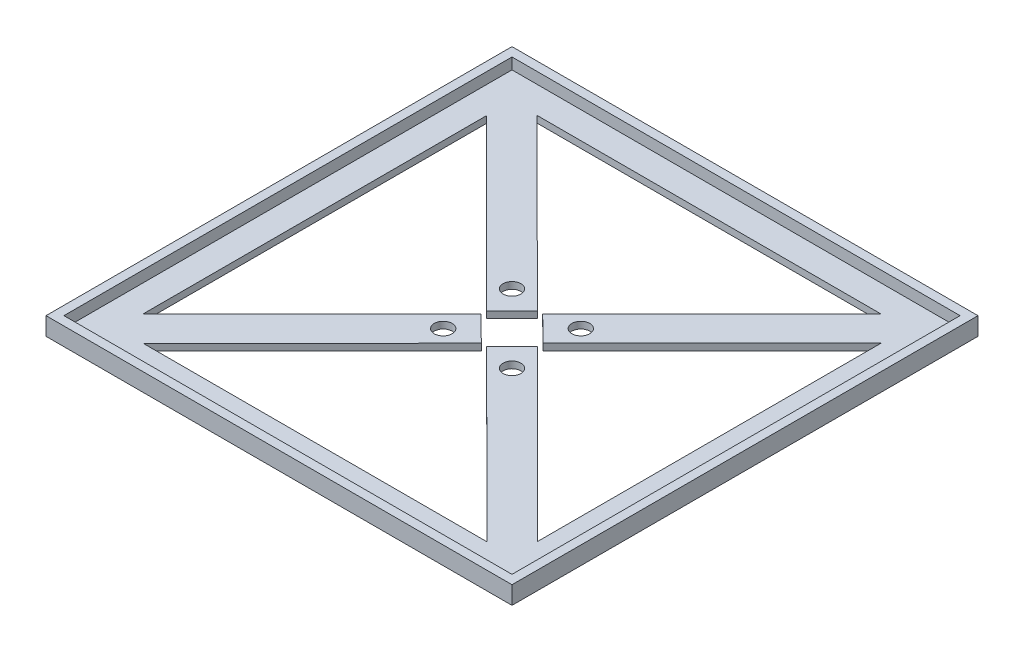
ISO-10303-21;
HEADER;
FILE_DESCRIPTION(('STEP AP214'),'2;1');
FILE_NAME('part.step','',(''),(''),'','','');
FILE_SCHEMA(('AUTOMOTIVE_DESIGN { 1 0 10303 214 1 1 1 1 }'));
ENDSEC;
DATA;
#1=APPLICATION_CONTEXT('core data for automotive mechanical design processes');
#2=APPLICATION_PROTOCOL_DEFINITION('international standard','automotive_design',2000,#1);
#3=PRODUCT_CONTEXT('',#1,'mechanical');
#4=PRODUCT('Part','Part','',(#3));
#5=PRODUCT_RELATED_PRODUCT_CATEGORY('part','',(#4));
#6=PRODUCT_DEFINITION_FORMATION('','',#4);
#7=PRODUCT_DEFINITION_CONTEXT('part definition',#1,'design');
#8=PRODUCT_DEFINITION('design','',#6,#7);
#9=PRODUCT_DEFINITION_SHAPE('','',#8);
#10=(LENGTH_UNIT() NAMED_UNIT(*) SI_UNIT(.MILLI.,.METRE.));
#11=(NAMED_UNIT(*) PLANE_ANGLE_UNIT() SI_UNIT($,.RADIAN.));
#12=(NAMED_UNIT(*) SI_UNIT($,.STERADIAN.) SOLID_ANGLE_UNIT());
#13=UNCERTAINTY_MEASURE_WITH_UNIT(LENGTH_MEASURE(1.E-05),#10,'distance_accuracy_value','');
#14=(GEOMETRIC_REPRESENTATION_CONTEXT(3) GLOBAL_UNCERTAINTY_ASSIGNED_CONTEXT((#13)) GLOBAL_UNIT_ASSIGNED_CONTEXT((#10,
#11,#12)) REPRESENTATION_CONTEXT('',''));
#15=CARTESIAN_POINT('',(0.,0.,0.));
#16=DIRECTION('',(0.,0.,1.));
#17=DIRECTION('',(1.,0.,0.));
#18=AXIS2_PLACEMENT_3D('',#15,#16,#17);
#19=CARTESIAN_POINT('',(0.,0.75,-24.1638593004796));
#20=DIRECTION('',(0.,0.,-1.));
#21=DIRECTION('',(-1.,0.,0.));
#22=AXIS2_PLACEMENT_3D('',#19,#20,#21);
#23=PLANE('',#22);
#24=DIRECTION('',(0.,1.,0.));
#25=VECTOR('',#24,1.);
#26=CARTESIAN_POINT('',(-25.5005446198042,0.75,-24.1638593004796));
#27=LINE('',#26,#25);
#28=CARTESIAN_POINT('',(-25.5005446198042,0.,-24.1638593004796));
#29=VERTEX_POINT('',#28);
#30=CARTESIAN_POINT('',(-25.5005446198042,0.75,-24.1638593004796));
#31=VERTEX_POINT('',#30);
#32=EDGE_CURVE('E340',#29,#31,#27,.T.);
#33=ORIENTED_EDGE('',*,*,#32,.F.);
#34=DIRECTION('',(1.,0.,0.));
#35=VECTOR('',#34,1.);
#36=CARTESIAN_POINT('',(0.,0.,-24.1638593004796));
#37=LINE('',#36,#35);
#38=CARTESIAN_POINT('',(12.8426470451121,0.,-24.1638593004796));
#39=VERTEX_POINT('',#38);
#40=EDGE_CURVE('E424',#29,#39,#37,.T.);
#41=ORIENTED_EDGE('',*,*,#40,.T.);
#42=DIRECTION('',(0.,-1.,0.));
#43=VECTOR('',#42,1.);
#44=CARTESIAN_POINT('',(12.8426470451121,0.75,-24.1638593004796));
#45=LINE('',#44,#43);
#46=CARTESIAN_POINT('',(12.8426470451121,0.75,-24.1638593004796));
#47=VERTEX_POINT('',#46);
#48=EDGE_CURVE('E12',#47,#39,#45,.T.);
#49=ORIENTED_EDGE('',*,*,#48,.F.);
#50=DIRECTION('',(1.,0.,0.));
#51=VECTOR('',#50,1.);
#52=CARTESIAN_POINT('',(0.,0.75,-24.1638593004796));
#53=LINE('',#52,#51);
#54=EDGE_CURVE('E425',#31,#47,#53,.T.);
#55=ORIENTED_EDGE('',*,*,#54,.F.);
#56=EDGE_LOOP('',(#33,#41,#49,#55));
#57=FACE_BOUND('',#56,.T.);
#58=ADVANCED_FACE('F85',(#57),#23,.F.);
#59=CARTESIAN_POINT('',(-28.2989469789886,0.75,0.));
#60=DIRECTION('',(1.,0.,0.));
#61=DIRECTION('',(0.,0.,-1.));
#62=AXIS2_PLACEMENT_3D('',#59,#60,#61);
#63=PLANE('',#62);
#64=DIRECTION('',(0.,0.,1.));
#65=VECTOR('',#64,1.);
#66=CARTESIAN_POINT('',(-28.2989469789886,0.,0.));
#67=LINE('',#66,#65);
#68=CARTESIAN_POINT('',(-28.2989469789886,0.,-21.3054533245803));
#69=VERTEX_POINT('',#68);
#70=CARTESIAN_POINT('',(-28.2989469789886,0.,17.0377383403361));
#71=VERTEX_POINT('',#70);
#72=EDGE_CURVE('E427',#69,#71,#67,.T.);
#73=ORIENTED_EDGE('',*,*,#72,.F.);
#74=DIRECTION('',(0.,1.,0.));
#75=VECTOR('',#74,1.);
#76=CARTESIAN_POINT('',(-28.2989469789886,0.75,-21.3054533245803));
#77=LINE('',#76,#75);
#78=CARTESIAN_POINT('',(-28.2989469789886,0.75,-21.3054533245803));
#79=VERTEX_POINT('',#78);
#80=EDGE_CURVE('E337',#69,#79,#77,.T.);
#81=ORIENTED_EDGE('',*,*,#80,.T.);
#82=DIRECTION('',(0.,0.,1.));
#83=VECTOR('',#82,1.);
#84=CARTESIAN_POINT('',(-28.2989469789886,0.75,0.));
#85=LINE('',#84,#83);
#86=CARTESIAN_POINT('',(-28.2989469789886,0.75,17.0377383403361));
#87=VERTEX_POINT('',#86);
#88=EDGE_CURVE('E431',#79,#87,#85,.T.);
#89=ORIENTED_EDGE('',*,*,#88,.T.);
#90=DIRECTION('',(0.,-1.,0.));
#91=VECTOR('',#90,1.);
#92=CARTESIAN_POINT('',(-28.2989469789886,0.75,17.037738340336));
#93=LINE('',#92,#91);
#94=EDGE_CURVE('E450',#87,#71,#93,.T.);
#95=ORIENTED_EDGE('',*,*,#94,.T.);
#96=EDGE_LOOP('',(#73,#81,#89,#95));
#97=FACE_BOUND('',#96,.T.);
#98=ADVANCED_FACE('F481',(#97),#63,.T.);
#99=CARTESIAN_POINT('',(15.7010530210114,0.75,0.));
#100=DIRECTION('',(1.,0.,0.));
#101=DIRECTION('',(0.,0.,-1.));
#102=AXIS2_PLACEMENT_3D('',#99,#100,#101);
#103=PLANE('',#102);
#104=DIRECTION('',(0.,1.,0.));
#105=VECTOR('',#104,1.);
#106=CARTESIAN_POINT('',(15.7010530210114,0.75,-21.3654569412953));
#107=LINE('',#106,#105);
#108=CARTESIAN_POINT('',(15.7010530210114,0.,-21.3654569412953));
#109=VERTEX_POINT('',#108);
#110=CARTESIAN_POINT('',(15.7010530210114,0.75,-21.3654569412953));
#111=VERTEX_POINT('',#110);
#112=EDGE_CURVE('E368',#109,#111,#107,.T.);
#113=ORIENTED_EDGE('',*,*,#112,.F.);
#114=DIRECTION('',(0.,0.,1.));
#115=VECTOR('',#114,1.);
#116=CARTESIAN_POINT('',(15.7010530210114,0.,0.));
#117=LINE('',#116,#115);
#118=CARTESIAN_POINT('',(15.7010530210114,0.,16.977734723621));
#119=VERTEX_POINT('',#118);
#120=EDGE_CURVE('E434',#109,#119,#117,.T.);
#121=ORIENTED_EDGE('',*,*,#120,.T.);
#122=DIRECTION('',(0.,-1.,0.));
#123=VECTOR('',#122,1.);
#124=CARTESIAN_POINT('',(15.7010530210114,0.75,16.977734723621));
#125=LINE('',#124,#123);
#126=CARTESIAN_POINT('',(15.7010530210114,0.75,16.977734723621));
#127=VERTEX_POINT('',#126);
#128=EDGE_CURVE('E93',#127,#119,#125,.T.);
#129=ORIENTED_EDGE('',*,*,#128,.F.);
#130=DIRECTION('',(0.,0.,1.));
#131=VECTOR('',#130,1.);
#132=CARTESIAN_POINT('',(15.7010530210114,0.75,0.));
#133=LINE('',#132,#131);
#134=EDGE_CURVE('E108',#111,#127,#133,.T.);
#135=ORIENTED_EDGE('',*,*,#134,.F.);
#136=EDGE_LOOP('',(#113,#121,#129,#135));
#137=FACE_BOUND('',#136,.T.);
#138=ADVANCED_FACE('F478',(#137),#103,.F.);
#139=CARTESIAN_POINT('',(0.,0.75,19.8361406995204));
#140=DIRECTION('',(0.,0.,-1.));
#141=DIRECTION('',(-1.,0.,0.));
#142=AXIS2_PLACEMENT_3D('',#139,#140,#141);
#143=PLANE('',#142);
#144=DIRECTION('',(1.,0.,0.));
#145=VECTOR('',#144,1.);
#146=CARTESIAN_POINT('',(0.,0.75,19.8361406995204));
#147=LINE('',#146,#145);
#148=CARTESIAN_POINT('',(-25.4405410030892,0.75,19.8361406995204));
#149=VERTEX_POINT('',#148);
#150=CARTESIAN_POINT('',(12.9026506618271,0.75,19.8361406995204));
#151=VERTEX_POINT('',#150);
#152=EDGE_CURVE('E429',#149,#151,#147,.T.);
#153=ORIENTED_EDGE('',*,*,#152,.T.);
#154=DIRECTION('',(0.,-1.,0.));
#155=VECTOR('',#154,1.);
#156=CARTESIAN_POINT('',(12.9026506618271,0.75,19.8361406995204));
#157=LINE('',#156,#155);
#158=CARTESIAN_POINT('',(12.9026506618271,0.,19.8361406995204));
#159=VERTEX_POINT('',#158);
#160=EDGE_CURVE('E396',#151,#159,#157,.T.);
#161=ORIENTED_EDGE('',*,*,#160,.T.);
#162=DIRECTION('',(1.,0.,0.));
#163=VECTOR('',#162,1.);
#164=CARTESIAN_POINT('',(0.,0.,19.8361406995204));
#165=LINE('',#164,#163);
#166=CARTESIAN_POINT('',(-25.4405410030892,0.,19.8361406995204));
#167=VERTEX_POINT('',#166);
#168=EDGE_CURVE('E436',#167,#159,#165,.T.);
#169=ORIENTED_EDGE('',*,*,#168,.F.);
#170=DIRECTION('',(0.,1.,0.));
#171=VECTOR('',#170,1.);
#172=CARTESIAN_POINT('',(-25.4405410030892,0.75,19.8361406995204));
#173=LINE('',#172,#171);
#174=EDGE_CURVE('E447',#167,#149,#173,.T.);
#175=ORIENTED_EDGE('',*,*,#174,.T.);
#176=EDGE_LOOP('',(#153,#161,#169,#175));
#177=FACE_BOUND('',#176,.T.);
#178=ADVANCED_FACE('F480',(#177),#143,.T.);
#179=CARTESIAN_POINT('',(0.,0.75,0.));
#180=DIRECTION('',(0.,-1.,0.));
#181=DIRECTION('',(0.,0.,-1.));
#182=AXIS2_PLACEMENT_3D('',#179,#180,#181);
#183=PLANE('',#182);
#184=DIRECTION('',(-0.707668696877532,0.,-0.706544418603428));
#185=VECTOR('',#184,1.);
#186=CARTESIAN_POINT('',(-0.64808539249805,0.75,0.649116648718275));
#187=LINE('',#186,#185);
#188=CARTESIAN_POINT('',(-6.60223918650174,0.75,-5.29557773895472));
#189=VERTEX_POINT('',#188);
#190=EDGE_CURVE('E318',#189,#31,#187,.T.);
#191=ORIENTED_EDGE('',*,*,#190,.T.);
#192=ORIENTED_EDGE('',*,*,#54,.T.);
#193=DIRECTION('',(-0.706544418603427,0.,0.707668696877533));
#194=VECTOR('',#193,1.);
#195=CARTESIAN_POINT('',(-5.65038115024693,0.75,-5.64140434966826));
#196=LINE('',#195,#194);
#197=CARTESIAN_POINT('',(-5.99790332802358,0.75,-5.2933291824065));
#198=VERTEX_POINT('',#197);
#199=EDGE_CURVE('E346',#47,#198,#196,.T.);
#200=ORIENTED_EDGE('',*,*,#199,.T.);
#201=DIRECTION('',(0.707668696877532,0.,0.706544418603427));
#202=VECTOR('',#201,1.);
#203=CARTESIAN_POINT('',(-0.347522177776656,0.75,0.348075167261757));
#204=LINE('',#203,#202);
#205=CARTESIAN_POINT('',(-3.16722854051345,0.75,-2.46715150799279));
#206=VERTEX_POINT('',#205);
#207=EDGE_CURVE('E349',#198,#206,#204,.T.);
#208=ORIENTED_EDGE('',*,*,#207,.T.);
#209=DIRECTION('',(0.706544418603427,0.,-0.707668696877532));
#210=VECTOR('',#209,1.);
#211=CARTESIAN_POINT('',(-2.8197063627368,0.75,-2.81522667525455));
#212=LINE('',#211,#210);
#213=EDGE_CURVE('E351',#206,#111,#212,.T.);
#214=ORIENTED_EDGE('',*,*,#213,.T.);
#215=ORIENTED_EDGE('',*,*,#134,.T.);
#216=DIRECTION('',(-0.707668696877533,0.,-0.706544418603427));
#217=VECTOR('',#216,1.);
#218=CARTESIAN_POINT('',(-0.650812215781393,0.75,0.651847811018522));
#219=LINE('',#218,#217);
#220=CARTESIAN_POINT('',(-3.16947709706168,0.75,-1.86281564951464));
#221=VERTEX_POINT('',#220);
#222=EDGE_CURVE('E374',#127,#221,#219,.T.);
#223=ORIENTED_EDGE('',*,*,#222,.T.);
#224=DIRECTION('',(-0.706544418603427,0.,0.707668696877532));
#225=VECTOR('',#224,1.);
#226=CARTESIAN_POINT('',(-2.51866488128028,0.75,-2.51466346053316));
#227=LINE('',#226,#225);
#228=CARTESIAN_POINT('',(-5.99565477147538,0.75,0.967859137995492));
#229=VERTEX_POINT('',#228);
#230=EDGE_CURVE('E377',#221,#229,#227,.T.);
#231=ORIENTED_EDGE('',*,*,#230,.T.);
#232=DIRECTION('',(0.707668696877532,0.,0.706544418603427));
#233=VECTOR('',#232,1.);
#234=CARTESIAN_POINT('',(-3.4769898901951,0.75,3.48252259852865));
#235=LINE('',#234,#233);
#236=EDGE_CURVE('E379',#229,#151,#235,.T.);
#237=ORIENTED_EDGE('',*,*,#236,.T.);
#238=ORIENTED_EDGE('',*,*,#152,.F.);
#239=DIRECTION('',(0.706544418603427,0.,-0.707668696877533));
#240=VECTOR('',#239,1.);
#241=CARTESIAN_POINT('',(-2.82243752503705,0.75,-2.8179534985379));
#242=LINE('',#241,#240);
#243=CARTESIAN_POINT('',(-6.59999062995354,0.75,0.965610581447271));
#244=VERTEX_POINT('',#243);
#245=EDGE_CURVE('E402',#149,#244,#242,.T.);
#246=ORIENTED_EDGE('',*,*,#245,.T.);
#247=DIRECTION('',(-0.707668696877532,0.,-0.706544418603428));
#248=VECTOR('',#247,1.);
#249=CARTESIAN_POINT('',(-3.77755310491649,0.75,3.78356407998517));
#250=LINE('',#249,#248);
#251=CARTESIAN_POINT('',(-9.43066541746366,0.75,-1.86056709296644));
#252=VERTEX_POINT('',#251);
#253=EDGE_CURVE('E405',#244,#252,#250,.T.);
#254=ORIENTED_EDGE('',*,*,#253,.T.);
#255=DIRECTION('',(-0.706544418603427,0.,0.707668696877532));
#256=VECTOR('',#255,1.);
#257=CARTESIAN_POINT('',(-5.65311231254717,0.75,-5.6441311729516));
#258=LINE('',#257,#256);
#259=EDGE_CURVE('E407',#252,#87,#258,.T.);
#260=ORIENTED_EDGE('',*,*,#259,.T.);
#261=ORIENTED_EDGE('',*,*,#88,.F.);
#262=DIRECTION('',(0.707668696877533,0.,0.706544418603427));
#263=VECTOR('',#262,1.);
#264=CARTESIAN_POINT('',(-3.47426306691175,0.75,3.4797914362284));
#265=LINE('',#264,#263);
#266=CARTESIAN_POINT('',(-9.42841686091544,0.75,-2.46490295144459));
#267=VERTEX_POINT('',#266);
#268=EDGE_CURVE('E321',#79,#267,#265,.T.);
#269=ORIENTED_EDGE('',*,*,#268,.T.);
#270=DIRECTION('',(0.706544418603427,0.,-0.707668696877532));
#271=VECTOR('',#270,1.);
#272=CARTESIAN_POINT('',(-5.95415379400369,0.75,-5.94469438767299));
#273=LINE('',#272,#271);
#274=EDGE_CURVE('E315',#267,#189,#273,.T.);
#275=ORIENTED_EDGE('',*,*,#274,.T.);
#276=EDGE_LOOP('',(#191,#192,#200,#208,#214,#215,#223,#231,#237,#238,#246,#254,#260,#261,#269,#275));
#277=FACE_BOUND('',#276,.T.);
#278=DIRECTION('',(0.,0.,1.));
#279=VECTOR('',#278,1.);
#280=CARTESIAN_POINT('',(18.7010530210114,0.75,-27.1638593004796));
#281=LINE('',#280,#279);
#282=CARTESIAN_POINT('',(18.7010530210114,0.75,-27.1638593004796));
#283=VERTEX_POINT('',#282);
#284=CARTESIAN_POINT('',(18.7010530210114,0.75,22.8361406995204));
#285=VERTEX_POINT('',#284);
#286=EDGE_CURVE('E441',#283,#285,#281,.T.);
#287=ORIENTED_EDGE('',*,*,#286,.F.);
#288=DIRECTION('',(1.,0.,0.));
#289=VECTOR('',#288,1.);
#290=CARTESIAN_POINT('',(-31.2989469789886,0.75,-27.1638593004796));
#291=LINE('',#290,#289);
#292=CARTESIAN_POINT('',(-31.2989469789886,0.75,-27.1638593004796));
#293=VERTEX_POINT('',#292);
#294=EDGE_CURVE('E254',#293,#283,#291,.T.);
#295=ORIENTED_EDGE('',*,*,#294,.F.);
#296=DIRECTION('',(0.,0.,1.));
#297=VECTOR('',#296,1.);
#298=CARTESIAN_POINT('',(-31.2989469789886,0.75,-27.1638593004796));
#299=LINE('',#298,#297);
#300=CARTESIAN_POINT('',(-31.2989469789886,0.75,22.8361406995204));
#301=VERTEX_POINT('',#300);
#302=EDGE_CURVE('E445',#293,#301,#299,.T.);
#303=ORIENTED_EDGE('',*,*,#302,.T.);
#304=DIRECTION('',(1.,0.,0.));
#305=VECTOR('',#304,1.);
#306=CARTESIAN_POINT('',(-31.2989469789886,0.75,22.8361406995204));
#307=LINE('',#306,#305);
#308=EDGE_CURVE('E443',#301,#285,#307,.T.);
#309=ORIENTED_EDGE('',*,*,#308,.T.);
#310=EDGE_LOOP('',(#287,#295,#303,#309));
#311=FACE_BOUND('',#310,.T.);
#312=CARTESIAN_POINT('',(-2.46124559070888,0.75,1.67384208780007));
#313=DIRECTION('',(0.,1.,0.));
#314=DIRECTION('',(0.,0.,1.));
#315=AXIS2_PLACEMENT_3D('',#312,#313,#314);
#316=CIRCLE('',#315,1.);
#317=CARTESIAN_POINT('',(-2.46124559070888,0.75,2.67384208780007));
#318=VERTEX_POINT('',#317);
#319=EDGE_CURVE('E371',#318,#318,#316,.T.);
#320=ORIENTED_EDGE('',*,*,#319,.F.);
#321=EDGE_LOOP('',(#320));
#322=FACE_BOUND('',#321,.T.);
#323=CARTESIAN_POINT('',(-10.1366483672682,0.75,1.67384208780007));
#324=DIRECTION('',(0.,1.,0.));
#325=DIRECTION('',(0.,0.,1.));
#326=AXIS2_PLACEMENT_3D('',#323,#324,#325);
#327=CIRCLE('',#326,1.);
#328=CARTESIAN_POINT('',(-10.1366483672682,0.75,2.67384208780007));
#329=VERTEX_POINT('',#328);
#330=EDGE_CURVE('E399',#329,#329,#327,.T.);
#331=ORIENTED_EDGE('',*,*,#330,.F.);
#332=EDGE_LOOP('',(#331));
#333=FACE_BOUND('',#332,.T.);
#334=CARTESIAN_POINT('',(-2.46124559070888,0.75,-6.00156068875929));
#335=DIRECTION('',(0.,1.,0.));
#336=DIRECTION('',(0.,0.,1.));
#337=AXIS2_PLACEMENT_3D('',#334,#335,#336);
#338=CIRCLE('',#337,1.);
#339=CARTESIAN_POINT('',(-2.46124559070888,0.75,-5.00156068875929));
#340=VERTEX_POINT('',#339);
#341=EDGE_CURVE('E343',#340,#340,#338,.T.);
#342=ORIENTED_EDGE('',*,*,#341,.F.);
#343=EDGE_LOOP('',(#342));
#344=FACE_BOUND('',#343,.T.);
#345=CARTESIAN_POINT('',(-10.1366483672682,0.75,-6.00156068875929));
#346=DIRECTION('',(0.,1.,0.));
#347=DIRECTION('',(0.,0.,1.));
#348=AXIS2_PLACEMENT_3D('',#345,#346,#347);
#349=CIRCLE('',#348,1.);
#350=CARTESIAN_POINT('',(-10.1366483672682,0.75,-5.00156068875929));
#351=VERTEX_POINT('',#350);
#352=EDGE_CURVE('E312',#351,#351,#349,.T.);
#353=ORIENTED_EDGE('',*,*,#352,.F.);
#354=EDGE_LOOP('',(#353));
#355=FACE_BOUND('',#354,.T.);
#356=ADVANCED_FACE('F470',(#277,#311,#322,#333,#344,#355),#183,.F.);
#357=CARTESIAN_POINT('',(0.,0.,0.));
#358=DIRECTION('',(0.,-1.,0.));
#359=DIRECTION('',(0.,0.,-1.));
#360=AXIS2_PLACEMENT_3D('',#357,#358,#359);
#361=PLANE('',#360);
#362=ORIENTED_EDGE('',*,*,#40,.F.);
#363=DIRECTION('',(-0.707668696877532,0.,-0.706544418603428));
#364=VECTOR('',#363,1.);
#365=CARTESIAN_POINT('',(-0.64808539249805,0.,0.649116648718275));
#366=LINE('',#365,#364);
#367=CARTESIAN_POINT('',(-6.60223918650174,0.,-5.29557773895472));
#368=VERTEX_POINT('',#367);
#369=EDGE_CURVE('E329',#368,#29,#366,.T.);
#370=ORIENTED_EDGE('',*,*,#369,.F.);
#371=DIRECTION('',(0.706544418603427,0.,-0.707668696877532));
#372=VECTOR('',#371,1.);
#373=CARTESIAN_POINT('',(-5.95415379400369,0.,-5.94469438767299));
#374=LINE('',#373,#372);
#375=CARTESIAN_POINT('',(-9.42841686091544,0.,-2.46490295144459));
#376=VERTEX_POINT('',#375);
#377=EDGE_CURVE('E326',#376,#368,#374,.T.);
#378=ORIENTED_EDGE('',*,*,#377,.F.);
#379=DIRECTION('',(0.707668696877533,0.,0.706544418603427));
#380=VECTOR('',#379,1.);
#381=CARTESIAN_POINT('',(-3.47426306691175,0.,3.4797914362284));
#382=LINE('',#381,#380);
#383=EDGE_CURVE('E100',#69,#376,#382,.T.);
#384=ORIENTED_EDGE('',*,*,#383,.F.);
#385=ORIENTED_EDGE('',*,*,#72,.T.);
#386=DIRECTION('',(-0.706544418603427,0.,0.707668696877532));
#387=VECTOR('',#386,1.);
#388=CARTESIAN_POINT('',(-5.65311231254717,0.,-5.6441311729516));
#389=LINE('',#388,#387);
#390=CARTESIAN_POINT('',(-9.43066541746366,0.,-1.86056709296644));
#391=VERTEX_POINT('',#390);
#392=EDGE_CURVE('E403',#391,#71,#389,.T.);
#393=ORIENTED_EDGE('',*,*,#392,.F.);
#394=DIRECTION('',(-0.707668696877532,0.,-0.706544418603428));
#395=VECTOR('',#394,1.);
#396=CARTESIAN_POINT('',(-3.77755310491649,0.,3.78356407998517));
#397=LINE('',#396,#395);
#398=CARTESIAN_POINT('',(-6.59999062995354,0.,0.965610581447271));
#399=VERTEX_POINT('',#398);
#400=EDGE_CURVE('E415',#399,#391,#397,.T.);
#401=ORIENTED_EDGE('',*,*,#400,.F.);
#402=DIRECTION('',(0.706544418603427,0.,-0.707668696877533));
#403=VECTOR('',#402,1.);
#404=CARTESIAN_POINT('',(-2.82243752503705,0.,-2.8179534985379));
#405=LINE('',#404,#403);
#406=EDGE_CURVE('E413',#167,#399,#405,.T.);
#407=ORIENTED_EDGE('',*,*,#406,.F.);
#408=ORIENTED_EDGE('',*,*,#168,.T.);
#409=DIRECTION('',(0.707668696877532,0.,0.706544418603427));
#410=VECTOR('',#409,1.);
#411=CARTESIAN_POINT('',(-3.4769898901951,0.,3.48252259852865));
#412=LINE('',#411,#410);
#413=CARTESIAN_POINT('',(-5.99565477147538,0.,0.967859137995492));
#414=VERTEX_POINT('',#413);
#415=EDGE_CURVE('E375',#414,#159,#412,.T.);
#416=ORIENTED_EDGE('',*,*,#415,.F.);
#417=DIRECTION('',(-0.706544418603427,0.,0.707668696877532));
#418=VECTOR('',#417,1.);
#419=CARTESIAN_POINT('',(-2.51866488128028,0.,-2.51466346053316));
#420=LINE('',#419,#418);
#421=CARTESIAN_POINT('',(-3.16947709706168,0.,-1.86281564951464));
#422=VERTEX_POINT('',#421);
#423=EDGE_CURVE('E387',#422,#414,#420,.T.);
#424=ORIENTED_EDGE('',*,*,#423,.F.);
#425=DIRECTION('',(-0.707668696877533,0.,-0.706544418603427));
#426=VECTOR('',#425,1.);
#427=CARTESIAN_POINT('',(-0.650812215781393,0.,0.651847811018522));
#428=LINE('',#427,#426);
#429=EDGE_CURVE('E385',#119,#422,#428,.T.);
#430=ORIENTED_EDGE('',*,*,#429,.F.);
#431=ORIENTED_EDGE('',*,*,#120,.F.);
#432=DIRECTION('',(0.706544418603427,0.,-0.707668696877532));
#433=VECTOR('',#432,1.);
#434=CARTESIAN_POINT('',(-2.8197063627368,0.,-2.81522667525455));
#435=LINE('',#434,#433);
#436=CARTESIAN_POINT('',(-3.16722854051345,0.,-2.46715150799279));
#437=VERTEX_POINT('',#436);
#438=EDGE_CURVE('E347',#437,#109,#435,.T.);
#439=ORIENTED_EDGE('',*,*,#438,.F.);
#440=DIRECTION('',(0.707668696877532,0.,0.706544418603427));
#441=VECTOR('',#440,1.);
#442=CARTESIAN_POINT('',(-0.347522177776656,0.,0.348075167261757));
#443=LINE('',#442,#441);
#444=CARTESIAN_POINT('',(-5.99790332802358,0.,-5.2933291824065));
#445=VERTEX_POINT('',#444);
#446=EDGE_CURVE('E359',#445,#437,#443,.T.);
#447=ORIENTED_EDGE('',*,*,#446,.F.);
#448=DIRECTION('',(-0.706544418603427,0.,0.707668696877533));
#449=VECTOR('',#448,1.);
#450=CARTESIAN_POINT('',(-5.65038115024693,0.,-5.64140434966826));
#451=LINE('',#450,#449);
#452=EDGE_CURVE('E357',#39,#445,#451,.T.);
#453=ORIENTED_EDGE('',*,*,#452,.F.);
#454=EDGE_LOOP('',(#362,#370,#378,#384,#385,#393,#401,#407,#408,#416,#424,#430,#431,#439,#447,#453));
#455=FACE_BOUND('',#454,.T.);
#456=CARTESIAN_POINT('',(-2.46124559070888,0.,-6.00156068875929));
#457=DIRECTION('',(0.,1.,0.));
#458=DIRECTION('',(0.,0.,1.));
#459=AXIS2_PLACEMENT_3D('',#456,#457,#458);
#460=CIRCLE('',#459,1.);
#461=CARTESIAN_POINT('',(-2.46124559070888,0.,-5.00156068875929));
#462=VERTEX_POINT('',#461);
#463=EDGE_CURVE('E342',#462,#462,#460,.T.);
#464=ORIENTED_EDGE('',*,*,#463,.T.);
#465=EDGE_LOOP('',(#464));
#466=FACE_BOUND('',#465,.T.);
#467=CARTESIAN_POINT('',(-2.46124559070888,0.,1.67384208780007));
#468=DIRECTION('',(0.,1.,0.));
#469=DIRECTION('',(0.,0.,1.));
#470=AXIS2_PLACEMENT_3D('',#467,#468,#469);
#471=CIRCLE('',#470,1.);
#472=CARTESIAN_POINT('',(-2.46124559070888,0.,2.67384208780007));
#473=VERTEX_POINT('',#472);
#474=EDGE_CURVE('E370',#473,#473,#471,.T.);
#475=ORIENTED_EDGE('',*,*,#474,.T.);
#476=EDGE_LOOP('',(#475));
#477=FACE_BOUND('',#476,.T.);
#478=CARTESIAN_POINT('',(-10.1366483672682,0.,1.67384208780007));
#479=DIRECTION('',(0.,1.,0.));
#480=DIRECTION('',(0.,0.,1.));
#481=AXIS2_PLACEMENT_3D('',#478,#479,#480);
#482=CIRCLE('',#481,1.);
#483=CARTESIAN_POINT('',(-10.1366483672682,0.,2.67384208780007));
#484=VERTEX_POINT('',#483);
#485=EDGE_CURVE('E398',#484,#484,#482,.T.);
#486=ORIENTED_EDGE('',*,*,#485,.T.);
#487=EDGE_LOOP('',(#486));
#488=FACE_BOUND('',#487,.T.);
#489=CARTESIAN_POINT('',(-10.1366483672682,0.,-6.00156068875929));
#490=DIRECTION('',(0.,1.,0.));
#491=DIRECTION('',(0.,0.,1.));
#492=AXIS2_PLACEMENT_3D('',#489,#490,#491);
#493=CIRCLE('',#492,1.);
#494=CARTESIAN_POINT('',(-10.1366483672682,0.,-5.00156068875929));
#495=VERTEX_POINT('',#494);
#496=EDGE_CURVE('E305',#495,#495,#493,.T.);
#497=ORIENTED_EDGE('',*,*,#496,.T.);
#498=EDGE_LOOP('',(#497));
#499=FACE_BOUND('',#498,.T.);
#500=DIRECTION('',(1.,0.,0.));
#501=VECTOR('',#500,1.);
#502=CARTESIAN_POINT('',(0.,0.,-28.1638593004796));
#503=LINE('',#502,#501);
#504=CARTESIAN_POINT('',(-32.2989469789886,0.,-28.1638593004796));
#505=VERTEX_POINT('',#504);
#506=CARTESIAN_POINT('',(19.7010530210114,0.,-28.1638593004796));
#507=VERTEX_POINT('',#506);
#508=EDGE_CURVE('E277',#505,#507,#503,.T.);
#509=ORIENTED_EDGE('',*,*,#508,.T.);
#510=DIRECTION('',(0.,0.,1.));
#511=VECTOR('',#510,1.);
#512=CARTESIAN_POINT('',(19.7010530210114,0.,0.));
#513=LINE('',#512,#511);
#514=CARTESIAN_POINT('',(19.7010530210114,0.,23.8361406995204));
#515=VERTEX_POINT('',#514);
#516=EDGE_CURVE('E296',#507,#515,#513,.T.);
#517=ORIENTED_EDGE('',*,*,#516,.T.);
#518=DIRECTION('',(1.,0.,0.));
#519=VECTOR('',#518,1.);
#520=CARTESIAN_POINT('',(0.,0.,23.8361406995204));
#521=LINE('',#520,#519);
#522=CARTESIAN_POINT('',(-32.2989469789886,0.,23.8361406995204));
#523=VERTEX_POINT('',#522);
#524=EDGE_CURVE('E299',#523,#515,#521,.T.);
#525=ORIENTED_EDGE('',*,*,#524,.F.);
#526=DIRECTION('',(0.,0.,1.));
#527=VECTOR('',#526,1.);
#528=CARTESIAN_POINT('',(-32.2989469789886,0.,0.));
#529=LINE('',#528,#527);
#530=EDGE_CURVE('E286',#505,#523,#529,.T.);
#531=ORIENTED_EDGE('',*,*,#530,.F.);
#532=EDGE_LOOP('',(#509,#517,#525,#531));
#533=FACE_BOUND('',#532,.T.);
#534=ADVANCED_FACE('F87',(#455,#466,#477,#488,#499,#533),#361,.T.);
#535=CARTESIAN_POINT('',(-2.82243752503705,0.75,-2.8179534985379));
#536=DIRECTION('',(-0.707668696877533,0.,-0.706544418603427));
#537=DIRECTION('',(-0.706544418603427,0.,0.707668696877533));
#538=AXIS2_PLACEMENT_3D('',#535,#536,#537);
#539=PLANE('',#538);
#540=ORIENTED_EDGE('',*,*,#174,.F.);
#541=ORIENTED_EDGE('',*,*,#406,.T.);
#542=DIRECTION('',(0.,-1.,0.));
#543=VECTOR('',#542,1.);
#544=CARTESIAN_POINT('',(-6.59999062995354,0.75,0.965610581447271));
#545=LINE('',#544,#543);
#546=EDGE_CURVE('E421',#244,#399,#545,.T.);
#547=ORIENTED_EDGE('',*,*,#546,.F.);
#548=ORIENTED_EDGE('',*,*,#245,.F.);
#549=EDGE_LOOP('',(#540,#541,#547,#548));
#550=FACE_BOUND('',#549,.T.);
#551=ADVANCED_FACE('F501',(#550),#539,.F.);
#552=CARTESIAN_POINT('',(-3.77755310491649,0.75,3.78356407998517));
#553=DIRECTION('',(-0.706544418603427,0.,0.707668696877532));
#554=DIRECTION('',(0.707668696877532,0.,0.706544418603428));
#555=AXIS2_PLACEMENT_3D('',#552,#553,#554);
#556=PLANE('',#555);
#557=ORIENTED_EDGE('',*,*,#400,.T.);
#558=DIRECTION('',(0.,-1.,0.));
#559=VECTOR('',#558,1.);
#560=CARTESIAN_POINT('',(-9.43066541746366,0.75,-1.86056709296644));
#561=LINE('',#560,#559);
#562=EDGE_CURVE('E410',#252,#391,#561,.T.);
#563=ORIENTED_EDGE('',*,*,#562,.F.);
#564=ORIENTED_EDGE('',*,*,#253,.F.);
#565=ORIENTED_EDGE('',*,*,#546,.T.);
#566=EDGE_LOOP('',(#557,#563,#564,#565));
#567=FACE_BOUND('',#566,.T.);
#568=ADVANCED_FACE('F505',(#567),#556,.F.);
#569=CARTESIAN_POINT('',(-5.65311231254717,0.75,-5.6441311729516));
#570=DIRECTION('',(0.707668696877532,0.,0.706544418603427));
#571=DIRECTION('',(0.706544418603427,0.,-0.707668696877532));
#572=AXIS2_PLACEMENT_3D('',#569,#570,#571);
#573=PLANE('',#572);
#574=ORIENTED_EDGE('',*,*,#94,.F.);
#575=ORIENTED_EDGE('',*,*,#259,.F.);
#576=ORIENTED_EDGE('',*,*,#562,.T.);
#577=ORIENTED_EDGE('',*,*,#392,.T.);
#578=EDGE_LOOP('',(#574,#575,#576,#577));
#579=FACE_BOUND('',#578,.T.);
#580=ADVANCED_FACE('F511',(#579),#573,.F.);
#581=CARTESIAN_POINT('',(-10.1366483672682,0.75,1.67384208780007));
#582=DIRECTION('',(0.,-1.,0.));
#583=DIRECTION('',(0.,0.,-1.));
#584=AXIS2_PLACEMENT_3D('',#581,#582,#583);
#585=CYLINDRICAL_SURFACE('',#584,1.);
#586=ORIENTED_EDGE('',*,*,#330,.T.);
#587=EDGE_LOOP('',(#586));
#588=FACE_BOUND('',#587,.T.);
#589=ORIENTED_EDGE('',*,*,#485,.F.);
#590=EDGE_LOOP('',(#589));
#591=FACE_BOUND('',#590,.T.);
#592=ADVANCED_FACE('F517',(#588,#591),#585,.F.);
#593=CARTESIAN_POINT('',(-0.650812215781393,0.75,0.651847811018522));
#594=DIRECTION('',(-0.706544418603427,0.,0.707668696877533));
#595=DIRECTION('',(0.707668696877533,0.,0.706544418603427));
#596=AXIS2_PLACEMENT_3D('',#593,#594,#595);
#597=PLANE('',#596);
#598=ORIENTED_EDGE('',*,*,#222,.F.);
#599=ORIENTED_EDGE('',*,*,#128,.T.);
#600=ORIENTED_EDGE('',*,*,#429,.T.);
#601=DIRECTION('',(0.,-1.,0.));
#602=VECTOR('',#601,1.);
#603=CARTESIAN_POINT('',(-3.16947709706168,0.75,-1.86281564951464));
#604=LINE('',#603,#602);
#605=EDGE_CURVE('E393',#221,#422,#604,.T.);
#606=ORIENTED_EDGE('',*,*,#605,.F.);
#607=EDGE_LOOP('',(#598,#599,#600,#606));
#608=FACE_BOUND('',#607,.T.);
#609=ADVANCED_FACE('F456',(#608),#597,.F.);
#610=CARTESIAN_POINT('',(-2.51866488128028,0.75,-2.51466346053316));
#611=DIRECTION('',(0.707668696877532,0.,0.706544418603427));
#612=DIRECTION('',(0.706544418603427,0.,-0.707668696877532));
#613=AXIS2_PLACEMENT_3D('',#610,#611,#612);
#614=PLANE('',#613);
#615=ORIENTED_EDGE('',*,*,#423,.T.);
#616=DIRECTION('',(0.,-1.,0.));
#617=VECTOR('',#616,1.);
#618=CARTESIAN_POINT('',(-5.99565477147538,0.75,0.967859137995492));
#619=LINE('',#618,#617);
#620=EDGE_CURVE('E382',#229,#414,#619,.T.);
#621=ORIENTED_EDGE('',*,*,#620,.F.);
#622=ORIENTED_EDGE('',*,*,#230,.F.);
#623=ORIENTED_EDGE('',*,*,#605,.T.);
#624=EDGE_LOOP('',(#615,#621,#622,#623));
#625=FACE_BOUND('',#624,.T.);
#626=ADVANCED_FACE('F467',(#625),#614,.F.);
#627=CARTESIAN_POINT('',(-3.4769898901951,0.75,3.48252259852865));
#628=DIRECTION('',(0.706544418603427,0.,-0.707668696877532));
#629=DIRECTION('',(-0.707668696877532,0.,-0.706544418603427));
#630=AXIS2_PLACEMENT_3D('',#627,#628,#629);
#631=PLANE('',#630);
#632=ORIENTED_EDGE('',*,*,#160,.F.);
#633=ORIENTED_EDGE('',*,*,#236,.F.);
#634=ORIENTED_EDGE('',*,*,#620,.T.);
#635=ORIENTED_EDGE('',*,*,#415,.T.);
#636=EDGE_LOOP('',(#632,#633,#634,#635));
#637=FACE_BOUND('',#636,.T.);
#638=ADVANCED_FACE('F597',(#637),#631,.F.);
#639=CARTESIAN_POINT('',(-2.46124559070888,0.75,1.67384208780007));
#640=DIRECTION('',(0.,-1.,0.));
#641=DIRECTION('',(0.,0.,-1.));
#642=AXIS2_PLACEMENT_3D('',#639,#640,#641);
#643=CYLINDRICAL_SURFACE('',#642,1.);
#644=ORIENTED_EDGE('',*,*,#319,.T.);
#645=EDGE_LOOP('',(#644));
#646=FACE_BOUND('',#645,.T.);
#647=ORIENTED_EDGE('',*,*,#474,.F.);
#648=EDGE_LOOP('',(#647));
#649=FACE_BOUND('',#648,.T.);
#650=ADVANCED_FACE('F586',(#646,#649),#643,.F.);
#651=CARTESIAN_POINT('',(-2.8197063627368,0.75,-2.81522667525455));
#652=DIRECTION('',(-0.707668696877532,0.,-0.706544418603427));
#653=DIRECTION('',(-0.706544418603427,0.,0.707668696877532));
#654=AXIS2_PLACEMENT_3D('',#651,#652,#653);
#655=PLANE('',#654);
#656=ORIENTED_EDGE('',*,*,#438,.T.);
#657=ORIENTED_EDGE('',*,*,#112,.T.);
#658=ORIENTED_EDGE('',*,*,#213,.F.);
#659=DIRECTION('',(0.,-1.,0.));
#660=VECTOR('',#659,1.);
#661=CARTESIAN_POINT('',(-3.16722854051345,0.75,-2.46715150799279));
#662=LINE('',#661,#660);
#663=EDGE_CURVE('E354',#206,#437,#662,.T.);
#664=ORIENTED_EDGE('',*,*,#663,.T.);
#665=EDGE_LOOP('',(#656,#657,#658,#664));
#666=FACE_BOUND('',#665,.T.);
#667=ADVANCED_FACE('F477',(#666),#655,.F.);
#668=CARTESIAN_POINT('',(-5.65038115024693,0.75,-5.64140434966826));
#669=DIRECTION('',(0.707668696877532,0.,0.706544418603427));
#670=DIRECTION('',(0.706544418603427,0.,-0.707668696877533));
#671=AXIS2_PLACEMENT_3D('',#668,#669,#670);
#672=PLANE('',#671);
#673=ORIENTED_EDGE('',*,*,#199,.F.);
#674=ORIENTED_EDGE('',*,*,#48,.T.);
#675=ORIENTED_EDGE('',*,*,#452,.T.);
#676=DIRECTION('',(0.,-1.,0.));
#677=VECTOR('',#676,1.);
#678=CARTESIAN_POINT('',(-5.99790332802358,0.75,-5.2933291824065));
#679=LINE('',#678,#677);
#680=EDGE_CURVE('E365',#198,#445,#679,.T.);
#681=ORIENTED_EDGE('',*,*,#680,.F.);
#682=EDGE_LOOP('',(#673,#674,#675,#681));
#683=FACE_BOUND('',#682,.T.);
#684=ADVANCED_FACE('F585',(#683),#672,.F.);
#685=CARTESIAN_POINT('',(-0.347522177776656,0.75,0.348075167261757));
#686=DIRECTION('',(0.706544418603427,0.,-0.707668696877532));
#687=DIRECTION('',(-0.707668696877532,0.,-0.706544418603427));
#688=AXIS2_PLACEMENT_3D('',#685,#686,#687);
#689=PLANE('',#688);
#690=ORIENTED_EDGE('',*,*,#446,.T.);
#691=ORIENTED_EDGE('',*,*,#663,.F.);
#692=ORIENTED_EDGE('',*,*,#207,.F.);
#693=ORIENTED_EDGE('',*,*,#680,.T.);
#694=EDGE_LOOP('',(#690,#691,#692,#693));
#695=FACE_BOUND('',#694,.T.);
#696=ADVANCED_FACE('F587',(#695),#689,.F.);
#697=CARTESIAN_POINT('',(-2.46124559070888,0.75,-6.00156068875929));
#698=DIRECTION('',(0.,-1.,0.));
#699=DIRECTION('',(0.,0.,-1.));
#700=AXIS2_PLACEMENT_3D('',#697,#698,#699);
#701=CYLINDRICAL_SURFACE('',#700,1.);
#702=ORIENTED_EDGE('',*,*,#341,.T.);
#703=EDGE_LOOP('',(#702));
#704=FACE_BOUND('',#703,.T.);
#705=ORIENTED_EDGE('',*,*,#463,.F.);
#706=EDGE_LOOP('',(#705));
#707=FACE_BOUND('',#706,.T.);
#708=ADVANCED_FACE('F575',(#704,#707),#701,.F.);
#709=CARTESIAN_POINT('',(-0.64808539249805,0.75,0.649116648718275));
#710=DIRECTION('',(-0.706544418603427,0.,0.707668696877532));
#711=DIRECTION('',(0.707668696877532,0.,0.706544418603428));
#712=AXIS2_PLACEMENT_3D('',#709,#710,#711);
#713=PLANE('',#712);
#714=ORIENTED_EDGE('',*,*,#369,.T.);
#715=ORIENTED_EDGE('',*,*,#32,.T.);
#716=ORIENTED_EDGE('',*,*,#190,.F.);
#717=DIRECTION('',(0.,-1.,0.));
#718=VECTOR('',#717,1.);
#719=CARTESIAN_POINT('',(-6.60223918650174,0.75,-5.29557773895472));
#720=LINE('',#719,#718);
#721=EDGE_CURVE('E334',#189,#368,#720,.T.);
#722=ORIENTED_EDGE('',*,*,#721,.T.);
#723=EDGE_LOOP('',(#714,#715,#716,#722));
#724=FACE_BOUND('',#723,.T.);
#725=ADVANCED_FACE('F571',(#724),#713,.F.);
#726=CARTESIAN_POINT('',(-5.95415379400369,0.75,-5.94469438767299));
#727=DIRECTION('',(-0.707668696877532,0.,-0.706544418603427));
#728=DIRECTION('',(-0.706544418603427,0.,0.707668696877532));
#729=AXIS2_PLACEMENT_3D('',#726,#727,#728);
#730=PLANE('',#729);
#731=ORIENTED_EDGE('',*,*,#377,.T.);
#732=ORIENTED_EDGE('',*,*,#721,.F.);
#733=ORIENTED_EDGE('',*,*,#274,.F.);
#734=DIRECTION('',(0.,-1.,0.));
#735=VECTOR('',#734,1.);
#736=CARTESIAN_POINT('',(-9.42841686091544,0.75,-2.46490295144459));
#737=LINE('',#736,#735);
#738=EDGE_CURVE('E323',#267,#376,#737,.T.);
#739=ORIENTED_EDGE('',*,*,#738,.T.);
#740=EDGE_LOOP('',(#731,#732,#733,#739));
#741=FACE_BOUND('',#740,.T.);
#742=ADVANCED_FACE('F574',(#741),#730,.F.);
#743=CARTESIAN_POINT('',(-10.1366483672682,0.75,-6.00156068875929));
#744=DIRECTION('',(0.,-1.,0.));
#745=DIRECTION('',(0.,0.,-1.));
#746=AXIS2_PLACEMENT_3D('',#743,#744,#745);
#747=CYLINDRICAL_SURFACE('',#746,1.);
#748=ORIENTED_EDGE('',*,*,#352,.T.);
#749=EDGE_LOOP('',(#748));
#750=FACE_BOUND('',#749,.T.);
#751=ORIENTED_EDGE('',*,*,#496,.F.);
#752=EDGE_LOOP('',(#751));
#753=FACE_BOUND('',#752,.T.);
#754=ADVANCED_FACE('F569',(#750,#753),#747,.F.);
#755=CARTESIAN_POINT('',(-3.47426306691175,0.75,3.4797914362284));
#756=DIRECTION('',(0.706544418603427,0.,-0.707668696877533));
#757=DIRECTION('',(-0.707668696877533,0.,-0.706544418603427));
#758=AXIS2_PLACEMENT_3D('',#755,#756,#757);
#759=PLANE('',#758);
#760=ORIENTED_EDGE('',*,*,#80,.F.);
#761=ORIENTED_EDGE('',*,*,#383,.T.);
#762=ORIENTED_EDGE('',*,*,#738,.F.);
#763=ORIENTED_EDGE('',*,*,#268,.F.);
#764=EDGE_LOOP('',(#760,#761,#762,#763));
#765=FACE_BOUND('',#764,.T.);
#766=ADVANCED_FACE('F566',(#765),#759,.F.);
#767=CARTESIAN_POINT('',(-31.2989469789886,2.,-27.1638593004796));
#768=DIRECTION('',(0.,0.,-1.));
#769=DIRECTION('',(-1.,0.,0.));
#770=AXIS2_PLACEMENT_3D('',#767,#768,#769);
#771=PLANE('',#770);
#772=DIRECTION('',(0.,-1.,0.));
#773=VECTOR('',#772,1.);
#774=CARTESIAN_POINT('',(-31.2989469789886,2.,-27.1638593004796));
#775=LINE('',#774,#773);
#776=CARTESIAN_POINT('',(-31.2989469789886,2.,-27.1638593004796));
#777=VERTEX_POINT('',#776);
#778=EDGE_CURVE('E275',#777,#293,#775,.T.);
#779=ORIENTED_EDGE('',*,*,#778,.T.);
#780=ORIENTED_EDGE('',*,*,#294,.T.);
#781=DIRECTION('',(0.,-1.,0.));
#782=VECTOR('',#781,1.);
#783=CARTESIAN_POINT('',(18.7010530210114,2.,-27.1638593004796));
#784=LINE('',#783,#782);
#785=CARTESIAN_POINT('',(18.7010530210114,2.,-27.1638593004796));
#786=VERTEX_POINT('',#785);
#787=EDGE_CURVE('E247',#786,#283,#784,.T.);
#788=ORIENTED_EDGE('',*,*,#787,.F.);
#789=DIRECTION('',(1.,0.,0.));
#790=VECTOR('',#789,1.);
#791=CARTESIAN_POINT('',(-31.2989469789886,2.,-27.1638593004796));
#792=LINE('',#791,#790);
#793=EDGE_CURVE('E252',#777,#786,#792,.T.);
#794=ORIENTED_EDGE('',*,*,#793,.F.);
#795=EDGE_LOOP('',(#779,#780,#788,#794));
#796=FACE_BOUND('',#795,.T.);
#797=ADVANCED_FACE('F250',(#796),#771,.F.);
#798=CARTESIAN_POINT('',(-31.2989469789886,2.,-27.1638593004796));
#799=DIRECTION('',(1.,0.,0.));
#800=DIRECTION('',(0.,0.,-1.));
#801=AXIS2_PLACEMENT_3D('',#798,#799,#800);
#802=PLANE('',#801);
#803=ORIENTED_EDGE('',*,*,#302,.F.);
#804=ORIENTED_EDGE('',*,*,#778,.F.);
#805=DIRECTION('',(0.,0.,1.));
#806=VECTOR('',#805,1.);
#807=CARTESIAN_POINT('',(-31.2989469789886,2.,-27.1638593004796));
#808=LINE('',#807,#806);
#809=CARTESIAN_POINT('',(-31.2989469789886,2.,22.8361406995204));
#810=VERTEX_POINT('',#809);
#811=EDGE_CURVE('E258',#777,#810,#808,.T.);
#812=ORIENTED_EDGE('',*,*,#811,.T.);
#813=DIRECTION('',(0.,-1.,0.));
#814=VECTOR('',#813,1.);
#815=CARTESIAN_POINT('',(-31.2989469789886,2.,22.8361406995204));
#816=LINE('',#815,#814);
#817=EDGE_CURVE('E278',#810,#301,#816,.T.);
#818=ORIENTED_EDGE('',*,*,#817,.T.);
#819=EDGE_LOOP('',(#803,#804,#812,#818));
#820=FACE_BOUND('',#819,.T.);
#821=ADVANCED_FACE('F660',(#820),#802,.T.);
#822=CARTESIAN_POINT('',(-31.2989469789886,2.,22.8361406995204));
#823=DIRECTION('',(0.,0.,-1.));
#824=DIRECTION('',(-1.,0.,0.));
#825=AXIS2_PLACEMENT_3D('',#822,#823,#824);
#826=PLANE('',#825);
#827=ORIENTED_EDGE('',*,*,#308,.F.);
#828=ORIENTED_EDGE('',*,*,#817,.F.);
#829=DIRECTION('',(1.,0.,0.));
#830=VECTOR('',#829,1.);
#831=CARTESIAN_POINT('',(-31.2989469789886,2.,22.8361406995204));
#832=LINE('',#831,#830);
#833=CARTESIAN_POINT('',(18.7010530210114,2.,22.8361406995204));
#834=VERTEX_POINT('',#833);
#835=EDGE_CURVE('E267',#810,#834,#832,.T.);
#836=ORIENTED_EDGE('',*,*,#835,.T.);
#837=DIRECTION('',(0.,-1.,0.));
#838=VECTOR('',#837,1.);
#839=CARTESIAN_POINT('',(18.7010530210114,2.,22.8361406995204));
#840=LINE('',#839,#838);
#841=EDGE_CURVE('E257',#834,#285,#840,.T.);
#842=ORIENTED_EDGE('',*,*,#841,.T.);
#843=EDGE_LOOP('',(#827,#828,#836,#842));
#844=FACE_BOUND('',#843,.T.);
#845=ADVANCED_FACE('F666',(#844),#826,.T.);
#846=CARTESIAN_POINT('',(18.7010530210114,2.,-27.1638593004796));
#847=DIRECTION('',(1.,0.,0.));
#848=DIRECTION('',(0.,0.,-1.));
#849=AXIS2_PLACEMENT_3D('',#846,#847,#848);
#850=PLANE('',#849);
#851=ORIENTED_EDGE('',*,*,#787,.T.);
#852=ORIENTED_EDGE('',*,*,#286,.T.);
#853=ORIENTED_EDGE('',*,*,#841,.F.);
#854=DIRECTION('',(0.,0.,1.));
#855=VECTOR('',#854,1.);
#856=CARTESIAN_POINT('',(18.7010530210114,2.,-27.1638593004796));
#857=LINE('',#856,#855);
#858=EDGE_CURVE('E261',#786,#834,#857,.T.);
#859=ORIENTED_EDGE('',*,*,#858,.F.);
#860=EDGE_LOOP('',(#851,#852,#853,#859));
#861=FACE_BOUND('',#860,.T.);
#862=ADVANCED_FACE('F262',(#861),#850,.F.);
#863=CARTESIAN_POINT('',(0.,2.,-28.1638593004796));
#864=DIRECTION('',(0.,0.,-1.));
#865=DIRECTION('',(-1.,0.,0.));
#866=AXIS2_PLACEMENT_3D('',#863,#864,#865);
#867=PLANE('',#866);
#868=ORIENTED_EDGE('',*,*,#508,.F.);
#869=DIRECTION('',(0.,-1.,0.));
#870=VECTOR('',#869,1.);
#871=CARTESIAN_POINT('',(-32.2989469789886,2.,-28.1638593004796));
#872=LINE('',#871,#870);
#873=CARTESIAN_POINT('',(-32.2989469789886,2.,-28.1638593004796));
#874=VERTEX_POINT('',#873);
#875=EDGE_CURVE('E303',#874,#505,#872,.T.);
#876=ORIENTED_EDGE('',*,*,#875,.F.);
#877=DIRECTION('',(1.,0.,0.));
#878=VECTOR('',#877,1.);
#879=CARTESIAN_POINT('',(0.,2.,-28.1638593004796));
#880=LINE('',#879,#878);
#881=CARTESIAN_POINT('',(19.7010530210114,2.,-28.1638593004796));
#882=VERTEX_POINT('',#881);
#883=EDGE_CURVE('E282',#874,#882,#880,.T.);
#884=ORIENTED_EDGE('',*,*,#883,.T.);
#885=DIRECTION('',(0.,-1.,0.));
#886=VECTOR('',#885,1.);
#887=CARTESIAN_POINT('',(19.7010530210114,2.,-28.1638593004796));
#888=LINE('',#887,#886);
#889=EDGE_CURVE('E293',#882,#507,#888,.T.);
#890=ORIENTED_EDGE('',*,*,#889,.T.);
#891=EDGE_LOOP('',(#868,#876,#884,#890));
#892=FACE_BOUND('',#891,.T.);
#893=ADVANCED_FACE('F538',(#892),#867,.T.);
#894=CARTESIAN_POINT('',(-32.2989469789886,2.,0.));
#895=DIRECTION('',(1.,0.,0.));
#896=DIRECTION('',(0.,0.,-1.));
#897=AXIS2_PLACEMENT_3D('',#894,#895,#896);
#898=PLANE('',#897);
#899=ORIENTED_EDGE('',*,*,#530,.T.);
#900=DIRECTION('',(0.,-1.,0.));
#901=VECTOR('',#900,1.);
#902=CARTESIAN_POINT('',(-32.2989469789886,2.,23.8361406995204));
#903=LINE('',#902,#901);
#904=CARTESIAN_POINT('',(-32.2989469789886,2.,23.8361406995204));
#905=VERTEX_POINT('',#904);
#906=EDGE_CURVE('E306',#905,#523,#903,.T.);
#907=ORIENTED_EDGE('',*,*,#906,.F.);
#908=DIRECTION('',(0.,0.,1.));
#909=VECTOR('',#908,1.);
#910=CARTESIAN_POINT('',(-32.2989469789886,2.,0.));
#911=LINE('',#910,#909);
#912=EDGE_CURVE('E291',#874,#905,#911,.T.);
#913=ORIENTED_EDGE('',*,*,#912,.F.);
#914=ORIENTED_EDGE('',*,*,#875,.T.);
#915=EDGE_LOOP('',(#899,#907,#913,#914));
#916=FACE_BOUND('',#915,.T.);
#917=ADVANCED_FACE('F550',(#916),#898,.F.);
#918=CARTESIAN_POINT('',(0.,2.,23.8361406995204));
#919=DIRECTION('',(0.,0.,-1.));
#920=DIRECTION('',(-1.,0.,0.));
#921=AXIS2_PLACEMENT_3D('',#918,#919,#920);
#922=PLANE('',#921);
#923=ORIENTED_EDGE('',*,*,#524,.T.);
#924=DIRECTION('',(0.,-1.,0.));
#925=VECTOR('',#924,1.);
#926=CARTESIAN_POINT('',(19.7010530210114,2.,23.8361406995204));
#927=LINE('',#926,#925);
#928=CARTESIAN_POINT('',(19.7010530210114,2.,23.8361406995204));
#929=VERTEX_POINT('',#928);
#930=EDGE_CURVE('E309',#929,#515,#927,.T.);
#931=ORIENTED_EDGE('',*,*,#930,.F.);
#932=DIRECTION('',(1.,0.,0.));
#933=VECTOR('',#932,1.);
#934=CARTESIAN_POINT('',(0.,2.,23.8361406995204));
#935=LINE('',#934,#933);
#936=EDGE_CURVE('E289',#905,#929,#935,.T.);
#937=ORIENTED_EDGE('',*,*,#936,.F.);
#938=ORIENTED_EDGE('',*,*,#906,.T.);
#939=EDGE_LOOP('',(#923,#931,#937,#938));
#940=FACE_BOUND('',#939,.T.);
#941=ADVANCED_FACE('F547',(#940),#922,.F.);
#942=CARTESIAN_POINT('',(19.7010530210114,2.,0.));
#943=DIRECTION('',(1.,0.,0.));
#944=DIRECTION('',(0.,0.,-1.));
#945=AXIS2_PLACEMENT_3D('',#942,#943,#944);
#946=PLANE('',#945);
#947=ORIENTED_EDGE('',*,*,#516,.F.);
#948=ORIENTED_EDGE('',*,*,#889,.F.);
#949=DIRECTION('',(0.,0.,1.));
#950=VECTOR('',#949,1.);
#951=CARTESIAN_POINT('',(19.7010530210114,2.,0.));
#952=LINE('',#951,#950);
#953=EDGE_CURVE('E285',#882,#929,#952,.T.);
#954=ORIENTED_EDGE('',*,*,#953,.T.);
#955=ORIENTED_EDGE('',*,*,#930,.T.);
#956=EDGE_LOOP('',(#947,#948,#954,#955));
#957=FACE_BOUND('',#956,.T.);
#958=ADVANCED_FACE('F543',(#957),#946,.T.);
#959=CARTESIAN_POINT('',(0.,2.,0.));
#960=DIRECTION('',(0.,-1.,0.));
#961=DIRECTION('',(0.,0.,-1.));
#962=AXIS2_PLACEMENT_3D('',#959,#960,#961);
#963=PLANE('',#962);
#964=ORIENTED_EDGE('',*,*,#811,.F.);
#965=ORIENTED_EDGE('',*,*,#793,.T.);
#966=ORIENTED_EDGE('',*,*,#858,.T.);
#967=ORIENTED_EDGE('',*,*,#835,.F.);
#968=EDGE_LOOP('',(#964,#965,#966,#967));
#969=FACE_BOUND('',#968,.T.);
#970=ORIENTED_EDGE('',*,*,#883,.F.);
#971=ORIENTED_EDGE('',*,*,#912,.T.);
#972=ORIENTED_EDGE('',*,*,#936,.T.);
#973=ORIENTED_EDGE('',*,*,#953,.F.);
#974=EDGE_LOOP('',(#970,#971,#972,#973));
#975=FACE_BOUND('',#974,.T.);
#976=ADVANCED_FACE('F269',(#969,#975),#963,.F.);
#977=CLOSED_SHELL('',(#58,#98,#138,#178,#356,#534,#551,#568,#580,#592,#609,#626,#638,#650,#667,
#684,#696,#708,#725,#742,#754,#766,#797,#821,#845,#862,#893,#917,#941,#958,#976));
#978=MANIFOLD_SOLID_BREP('B2',#977);
#979=ADVANCED_BREP_SHAPE_REPRESENTATION('',(#18,#978),#14);
#980=SHAPE_DEFINITION_REPRESENTATION(#9,#979);
ENDSEC;
END-ISO-10303-21;
